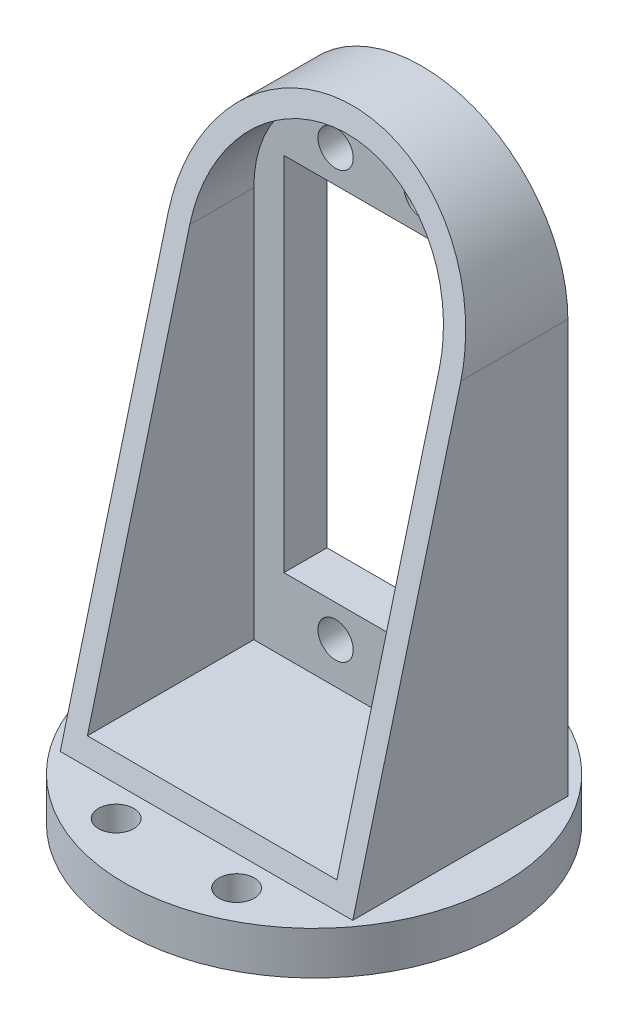
ISO-10303-21;
HEADER;
FILE_DESCRIPTION(('STEP AP214'),'2;1');
FILE_NAME('part.step','',(''),(''),'','','');
FILE_SCHEMA(('AUTOMOTIVE_DESIGN { 1 0 10303 214 1 1 1 1 }'));
ENDSEC;
DATA;
#1=APPLICATION_CONTEXT('core data for automotive mechanical design processes');
#2=APPLICATION_PROTOCOL_DEFINITION('international standard','automotive_design',2000,#1);
#3=PRODUCT_CONTEXT('',#1,'mechanical');
#4=PRODUCT('Part','Part','',(#3));
#5=PRODUCT_RELATED_PRODUCT_CATEGORY('part','',(#4));
#6=PRODUCT_DEFINITION_FORMATION('','',#4);
#7=PRODUCT_DEFINITION_CONTEXT('part definition',#1,'design');
#8=PRODUCT_DEFINITION('design','',#6,#7);
#9=PRODUCT_DEFINITION_SHAPE('','',#8);
#10=(LENGTH_UNIT() NAMED_UNIT(*) SI_UNIT(.MILLI.,.METRE.));
#11=(NAMED_UNIT(*) PLANE_ANGLE_UNIT() SI_UNIT($,.RADIAN.));
#12=(NAMED_UNIT(*) SI_UNIT($,.STERADIAN.) SOLID_ANGLE_UNIT());
#13=UNCERTAINTY_MEASURE_WITH_UNIT(LENGTH_MEASURE(1.E-05),#10,'distance_accuracy_value','');
#14=(GEOMETRIC_REPRESENTATION_CONTEXT(3) GLOBAL_UNCERTAINTY_ASSIGNED_CONTEXT((#13)) GLOBAL_UNIT_ASSIGNED_CONTEXT((#10,
#11,#12)) REPRESENTATION_CONTEXT('',''));
#15=CARTESIAN_POINT('',(0.,0.,0.));
#16=DIRECTION('',(0.,0.,1.));
#17=DIRECTION('',(1.,0.,0.));
#18=AXIS2_PLACEMENT_3D('',#15,#16,#17);
#19=CARTESIAN_POINT('',(17.,0.,5.));
#20=DIRECTION('',(1.,0.,0.));
#21=DIRECTION('',(0.,1.,0.));
#22=AXIS2_PLACEMENT_3D('',#19,#20,#21);
#23=PLANE('',#22);
#24=DIRECTION('',(0.,0.967459022681129,-0.253027744393526));
#25=VECTOR('',#24,1.);
#26=CARTESIAN_POINT('',(17.,-32.,25.));
#27=LINE('',#26,#25);
#28=CARTESIAN_POINT('',(17.,-32.,25.));
#29=VERTEX_POINT('',#28);
#30=CARTESIAN_POINT('',(17.,16.,12.4461538461538));
#31=VERTEX_POINT('',#30);
#32=EDGE_CURVE('E482',#29,#31,#27,.T.);
#33=ORIENTED_EDGE('',*,*,#32,.F.);
#34=DIRECTION('',(0.,0.,-1.));
#35=VECTOR('',#34,1.);
#36=CARTESIAN_POINT('',(17.,-32.,5.));
#37=LINE('',#36,#35);
#38=CARTESIAN_POINT('',(17.,-32.,0.));
#39=VERTEX_POINT('',#38);
#40=EDGE_CURVE('E174',#29,#39,#37,.T.);
#41=ORIENTED_EDGE('',*,*,#40,.T.);
#42=DIRECTION('',(0.,-1.,0.));
#43=VECTOR('',#42,1.);
#44=CARTESIAN_POINT('',(17.,0.,0.));
#45=LINE('',#44,#43);
#46=CARTESIAN_POINT('',(17.,16.,0.));
#47=VERTEX_POINT('',#46);
#48=EDGE_CURVE('E154',#47,#39,#45,.T.);
#49=ORIENTED_EDGE('',*,*,#48,.F.);
#50=DIRECTION('',(0.,0.,-1.));
#51=VECTOR('',#50,1.);
#52=CARTESIAN_POINT('',(17.,16.,5.));
#53=LINE('',#52,#51);
#54=EDGE_CURVE('E65',#31,#47,#53,.T.);
#55=ORIENTED_EDGE('',*,*,#54,.F.);
#56=EDGE_LOOP('',(#33,#41,#49,#55));
#57=FACE_BOUND('',#56,.T.);
#58=ADVANCED_FACE('F58',(#57),#23,.T.);
#59=CARTESIAN_POINT('',(0.,16.,5.));
#60=DIRECTION('',(0.,0.,-1.));
#61=DIRECTION('',(-1.,0.,0.));
#62=AXIS2_PLACEMENT_3D('',#59,#60,#61);
#63=CYLINDRICAL_SURFACE('',#62,17.);
#64=CARTESIAN_POINT('',(0.,16.,12.4461538461538));
#65=DIRECTION('',(0.,-0.253027744393526,-0.967459022681128));
#66=DIRECTION('',(0.,0.967459022681129,-0.253027744393526));
#67=AXIS2_PLACEMENT_3D('',#64,#65,#66);
#68=ELLIPSE('',#67,17.5718036644981,17.);
#69=CARTESIAN_POINT('',(-17.,16.,12.4461538461538));
#70=VERTEX_POINT('',#69);
#71=EDGE_CURVE('E183',#70,#31,#68,.T.);
#72=ORIENTED_EDGE('',*,*,#71,.T.);
#73=ORIENTED_EDGE('',*,*,#54,.T.);
#74=CARTESIAN_POINT('',(0.,16.,0.));
#75=DIRECTION('',(0.,0.,1.));
#76=DIRECTION('',(1.,0.,0.));
#77=AXIS2_PLACEMENT_3D('',#74,#75,#76);
#78=CIRCLE('',#77,17.);
#79=CARTESIAN_POINT('',(-17.,16.,0.));
#80=VERTEX_POINT('',#79);
#81=EDGE_CURVE('E169',#47,#80,#78,.T.);
#82=ORIENTED_EDGE('',*,*,#81,.T.);
#83=DIRECTION('',(0.,0.,-1.));
#84=VECTOR('',#83,1.);
#85=CARTESIAN_POINT('',(-17.,16.,5.));
#86=LINE('',#85,#84);
#87=EDGE_CURVE('E167',#70,#80,#86,.T.);
#88=ORIENTED_EDGE('',*,*,#87,.F.);
#89=EDGE_LOOP('',(#72,#73,#82,#88));
#90=FACE_BOUND('',#89,.T.);
#91=ADVANCED_FACE('F182',(#90),#63,.T.);
#92=CARTESIAN_POINT('',(-17.,0.,5.));
#93=DIRECTION('',(1.,0.,0.));
#94=DIRECTION('',(0.,1.,0.));
#95=AXIS2_PLACEMENT_3D('',#92,#93,#94);
#96=PLANE('',#95);
#97=DIRECTION('',(0.,0.,-1.));
#98=VECTOR('',#97,1.);
#99=CARTESIAN_POINT('',(-17.,-32.,5.));
#100=LINE('',#99,#98);
#101=CARTESIAN_POINT('',(-17.,-32.,25.));
#102=VERTEX_POINT('',#101);
#103=CARTESIAN_POINT('',(-17.,-32.,0.));
#104=VERTEX_POINT('',#103);
#105=EDGE_CURVE('E164',#102,#104,#100,.T.);
#106=ORIENTED_EDGE('',*,*,#105,.F.);
#107=DIRECTION('',(0.,0.967459022681129,-0.253027744393526));
#108=VECTOR('',#107,1.);
#109=CARTESIAN_POINT('',(-17.,-32.,25.));
#110=LINE('',#109,#108);
#111=EDGE_CURVE('E485',#102,#70,#110,.T.);
#112=ORIENTED_EDGE('',*,*,#111,.T.);
#113=ORIENTED_EDGE('',*,*,#87,.T.);
#114=DIRECTION('',(0.,-1.,0.));
#115=VECTOR('',#114,1.);
#116=CARTESIAN_POINT('',(-17.,0.,0.));
#117=LINE('',#116,#115);
#118=EDGE_CURVE('E152',#80,#104,#117,.T.);
#119=ORIENTED_EDGE('',*,*,#118,.T.);
#120=EDGE_LOOP('',(#106,#112,#113,#119));
#121=FACE_BOUND('',#120,.T.);
#122=ADVANCED_FACE('F162',(#121),#96,.F.);
#123=CARTESIAN_POINT('',(5.00000000000051,-24.75,5.));
#124=DIRECTION('',(0.,0.,-1.));
#125=DIRECTION('',(-1.,0.,0.));
#126=AXIS2_PLACEMENT_3D('',#123,#124,#125);
#127=CYLINDRICAL_SURFACE('',#126,2.05);
#128=CARTESIAN_POINT('',(5.00000000000051,-24.75,5.));
#129=DIRECTION('',(0.,0.,1.));
#130=DIRECTION('',(1.,0.,0.));
#131=AXIS2_PLACEMENT_3D('',#128,#129,#130);
#132=CIRCLE('',#131,2.05);
#133=CARTESIAN_POINT('',(7.05000000000051,-24.75,5.));
#134=VERTEX_POINT('',#133);
#135=EDGE_CURVE('E213',#134,#134,#132,.T.);
#136=ORIENTED_EDGE('',*,*,#135,.T.);
#137=EDGE_LOOP('',(#136));
#138=FACE_BOUND('',#137,.T.);
#139=CARTESIAN_POINT('',(5.00000000000051,-24.75,0.));
#140=DIRECTION('',(0.,0.,1.));
#141=DIRECTION('',(1.,0.,0.));
#142=AXIS2_PLACEMENT_3D('',#139,#140,#141);
#143=CIRCLE('',#142,2.05);
#144=CARTESIAN_POINT('',(7.05000000000051,-24.75,0.));
#145=VERTEX_POINT('',#144);
#146=EDGE_CURVE('E200',#145,#145,#143,.T.);
#147=ORIENTED_EDGE('',*,*,#146,.F.);
#148=EDGE_LOOP('',(#147));
#149=FACE_BOUND('',#148,.T.);
#150=ADVANCED_FACE('F249',(#138,#149),#127,.F.);
#151=CARTESIAN_POINT('',(-5.00000000000026,24.75,5.));
#152=DIRECTION('',(0.,0.,-1.));
#153=DIRECTION('',(-1.,0.,0.));
#154=AXIS2_PLACEMENT_3D('',#151,#152,#153);
#155=CYLINDRICAL_SURFACE('',#154,2.05000000000024);
#156=CARTESIAN_POINT('',(-5.00000000000026,24.75,5.));
#157=DIRECTION('',(0.,0.,1.));
#158=DIRECTION('',(1.,0.,0.));
#159=AXIS2_PLACEMENT_3D('',#156,#157,#158);
#160=CIRCLE('',#159,2.05000000000024);
#161=CARTESIAN_POINT('',(-2.95000000000002,24.75,5.));
#162=VERTEX_POINT('',#161);
#163=EDGE_CURVE('E208',#162,#162,#160,.T.);
#164=ORIENTED_EDGE('',*,*,#163,.T.);
#165=EDGE_LOOP('',(#164));
#166=FACE_BOUND('',#165,.T.);
#167=CARTESIAN_POINT('',(-5.00000000000026,24.75,0.));
#168=DIRECTION('',(0.,0.,1.));
#169=DIRECTION('',(1.,0.,0.));
#170=AXIS2_PLACEMENT_3D('',#167,#168,#169);
#171=CIRCLE('',#170,2.05000000000024);
#172=CARTESIAN_POINT('',(-2.95000000000002,24.75,0.));
#173=VERTEX_POINT('',#172);
#174=EDGE_CURVE('E197',#173,#173,#171,.T.);
#175=ORIENTED_EDGE('',*,*,#174,.F.);
#176=EDGE_LOOP('',(#175));
#177=FACE_BOUND('',#176,.T.);
#178=ADVANCED_FACE('F254',(#166,#177),#155,.F.);
#179=CARTESIAN_POINT('',(4.99999999999974,24.75,5.));
#180=DIRECTION('',(0.,0.,-1.));
#181=DIRECTION('',(-1.,0.,0.));
#182=AXIS2_PLACEMENT_3D('',#179,#180,#181);
#183=CYLINDRICAL_SURFACE('',#182,2.05000000000024);
#184=CARTESIAN_POINT('',(4.99999999999974,24.75,5.));
#185=DIRECTION('',(0.,0.,1.));
#186=DIRECTION('',(1.,0.,0.));
#187=AXIS2_PLACEMENT_3D('',#184,#185,#186);
#188=CIRCLE('',#187,2.05000000000024);
#189=CARTESIAN_POINT('',(7.04999999999999,24.75,5.));
#190=VERTEX_POINT('',#189);
#191=EDGE_CURVE('E204',#190,#190,#188,.T.);
#192=ORIENTED_EDGE('',*,*,#191,.T.);
#193=EDGE_LOOP('',(#192));
#194=FACE_BOUND('',#193,.T.);
#195=CARTESIAN_POINT('',(4.99999999999974,24.75,0.));
#196=DIRECTION('',(0.,0.,1.));
#197=DIRECTION('',(1.,0.,0.));
#198=AXIS2_PLACEMENT_3D('',#195,#196,#197);
#199=CIRCLE('',#198,2.05000000000024);
#200=CARTESIAN_POINT('',(7.04999999999999,24.75,0.));
#201=VERTEX_POINT('',#200);
#202=EDGE_CURVE('E158',#201,#201,#199,.T.);
#203=ORIENTED_EDGE('',*,*,#202,.F.);
#204=EDGE_LOOP('',(#203));
#205=FACE_BOUND('',#204,.T.);
#206=ADVANCED_FACE('F238',(#194,#205),#183,.F.);
#207=CARTESIAN_POINT('',(-4.99999999999949,-24.75,5.));
#208=DIRECTION('',(0.,0.,-1.));
#209=DIRECTION('',(-1.,0.,0.));
#210=AXIS2_PLACEMENT_3D('',#207,#208,#209);
#211=CYLINDRICAL_SURFACE('',#210,2.05);
#212=CARTESIAN_POINT('',(-4.99999999999949,-24.75,5.));
#213=DIRECTION('',(0.,0.,1.));
#214=DIRECTION('',(1.,0.,0.));
#215=AXIS2_PLACEMENT_3D('',#212,#213,#214);
#216=CIRCLE('',#215,2.05);
#217=CARTESIAN_POINT('',(-2.94999999999949,-24.75,5.));
#218=VERTEX_POINT('',#217);
#219=EDGE_CURVE('E177',#218,#218,#216,.T.);
#220=ORIENTED_EDGE('',*,*,#219,.T.);
#221=EDGE_LOOP('',(#220));
#222=FACE_BOUND('',#221,.T.);
#223=CARTESIAN_POINT('',(-4.99999999999949,-24.75,0.));
#224=DIRECTION('',(0.,0.,1.));
#225=DIRECTION('',(1.,0.,0.));
#226=AXIS2_PLACEMENT_3D('',#223,#224,#225);
#227=CIRCLE('',#226,2.05);
#228=CARTESIAN_POINT('',(-2.94999999999949,-24.75,0.));
#229=VERTEX_POINT('',#228);
#230=EDGE_CURVE('E202',#229,#229,#227,.T.);
#231=ORIENTED_EDGE('',*,*,#230,.F.);
#232=EDGE_LOOP('',(#231));
#233=FACE_BOUND('',#232,.T.);
#234=ADVANCED_FACE('F224',(#222,#233),#211,.F.);
#235=CARTESIAN_POINT('',(0.,0.,5.));
#236=DIRECTION('',(0.,0.,1.));
#237=DIRECTION('',(1.,0.,0.));
#238=AXIS2_PLACEMENT_3D('',#235,#236,#237);
#239=PLANE('',#238);
#240=CARTESIAN_POINT('',(0.,16.,5.));
#241=DIRECTION('',(0.,0.,1.));
#242=DIRECTION('',(1.,0.,0.));
#243=AXIS2_PLACEMENT_3D('',#240,#241,#242);
#244=CIRCLE('',#243,14.5);
#245=CARTESIAN_POINT('',(14.5,16.,5.));
#246=VERTEX_POINT('',#245);
#247=CARTESIAN_POINT('',(-14.5,16.,5.));
#248=VERTEX_POINT('',#247);
#249=EDGE_CURVE('E494',#246,#248,#244,.T.);
#250=ORIENTED_EDGE('',*,*,#249,.T.);
#251=DIRECTION('',(0.,-1.,0.));
#252=VECTOR('',#251,1.);
#253=CARTESIAN_POINT('',(-14.5,16.,5.));
#254=LINE('',#253,#252);
#255=CARTESIAN_POINT('',(-14.5,-29.5,5.));
#256=VERTEX_POINT('',#255);
#257=EDGE_CURVE('E496',#248,#256,#254,.T.);
#258=ORIENTED_EDGE('',*,*,#257,.T.);
#259=DIRECTION('',(1.,0.,0.));
#260=VECTOR('',#259,1.);
#261=CARTESIAN_POINT('',(-14.5,-29.5,5.));
#262=LINE('',#261,#260);
#263=CARTESIAN_POINT('',(14.5,-29.5,5.));
#264=VERTEX_POINT('',#263);
#265=EDGE_CURVE('E499',#256,#264,#262,.T.);
#266=ORIENTED_EDGE('',*,*,#265,.T.);
#267=DIRECTION('',(0.,1.,0.));
#268=VECTOR('',#267,1.);
#269=CARTESIAN_POINT('',(14.5,-29.5,5.));
#270=LINE('',#269,#268);
#271=EDGE_CURVE('E502',#264,#246,#270,.T.);
#272=ORIENTED_EDGE('',*,*,#271,.T.);
#273=EDGE_LOOP('',(#250,#258,#266,#272));
#274=FACE_BOUND('',#273,.T.);
#275=DIRECTION('',(1.,0.,0.));
#276=VECTOR('',#275,1.);
#277=CARTESIAN_POINT('',(-11.,21.,5.));
#278=LINE('',#277,#276);
#279=CARTESIAN_POINT('',(-11.,21.,5.));
#280=VERTEX_POINT('',#279);
#281=CARTESIAN_POINT('',(11.,21.,5.));
#282=VERTEX_POINT('',#281);
#283=EDGE_CURVE('E514',#280,#282,#278,.T.);
#284=ORIENTED_EDGE('',*,*,#283,.T.);
#285=DIRECTION('',(0.,1.,0.));
#286=VECTOR('',#285,1.);
#287=CARTESIAN_POINT('',(11.,-21.,5.));
#288=LINE('',#287,#286);
#289=CARTESIAN_POINT('',(11.,-21.,5.));
#290=VERTEX_POINT('',#289);
#291=EDGE_CURVE('E517',#290,#282,#288,.T.);
#292=ORIENTED_EDGE('',*,*,#291,.F.);
#293=DIRECTION('',(1.,0.,0.));
#294=VECTOR('',#293,1.);
#295=CARTESIAN_POINT('',(-11.,-21.,5.));
#296=LINE('',#295,#294);
#297=CARTESIAN_POINT('',(-11.,-21.,5.));
#298=VERTEX_POINT('',#297);
#299=EDGE_CURVE('E520',#298,#290,#296,.T.);
#300=ORIENTED_EDGE('',*,*,#299,.F.);
#301=DIRECTION('',(0.,1.,0.));
#302=VECTOR('',#301,1.);
#303=CARTESIAN_POINT('',(-11.,-21.,5.));
#304=LINE('',#303,#302);
#305=EDGE_CURVE('E523',#298,#280,#304,.T.);
#306=ORIENTED_EDGE('',*,*,#305,.T.);
#307=EDGE_LOOP('',(#284,#292,#300,#306));
#308=FACE_BOUND('',#307,.T.);
#309=ORIENTED_EDGE('',*,*,#191,.F.);
#310=EDGE_LOOP('',(#309));
#311=FACE_BOUND('',#310,.T.);
#312=ORIENTED_EDGE('',*,*,#163,.F.);
#313=EDGE_LOOP('',(#312));
#314=FACE_BOUND('',#313,.T.);
#315=ORIENTED_EDGE('',*,*,#135,.F.);
#316=EDGE_LOOP('',(#315));
#317=FACE_BOUND('',#316,.T.);
#318=ORIENTED_EDGE('',*,*,#219,.F.);
#319=EDGE_LOOP('',(#318));
#320=FACE_BOUND('',#319,.T.);
#321=ADVANCED_FACE('F227',(#274,#308,#311,#314,#317,#320),#239,.T.);
#322=CARTESIAN_POINT('',(0.,0.,0.));
#323=DIRECTION('',(0.,0.,1.));
#324=DIRECTION('',(1.,0.,0.));
#325=AXIS2_PLACEMENT_3D('',#322,#323,#324);
#326=PLANE('',#325);
#327=DIRECTION('',(0.,1.,0.));
#328=VECTOR('',#327,1.);
#329=CARTESIAN_POINT('',(11.,-21.,0.));
#330=LINE('',#329,#328);
#331=CARTESIAN_POINT('',(11.,-21.,0.));
#332=VERTEX_POINT('',#331);
#333=CARTESIAN_POINT('',(11.,21.,0.));
#334=VERTEX_POINT('',#333);
#335=EDGE_CURVE('E527',#332,#334,#330,.T.);
#336=ORIENTED_EDGE('',*,*,#335,.T.);
#337=DIRECTION('',(1.,0.,0.));
#338=VECTOR('',#337,1.);
#339=CARTESIAN_POINT('',(-11.,21.,0.));
#340=LINE('',#339,#338);
#341=CARTESIAN_POINT('',(-11.,21.,0.));
#342=VERTEX_POINT('',#341);
#343=EDGE_CURVE('E513',#342,#334,#340,.T.);
#344=ORIENTED_EDGE('',*,*,#343,.F.);
#345=DIRECTION('',(0.,1.,0.));
#346=VECTOR('',#345,1.);
#347=CARTESIAN_POINT('',(-11.,-21.,0.));
#348=LINE('',#347,#346);
#349=CARTESIAN_POINT('',(-11.,-21.,0.));
#350=VERTEX_POINT('',#349);
#351=EDGE_CURVE('E518',#350,#342,#348,.T.);
#352=ORIENTED_EDGE('',*,*,#351,.F.);
#353=DIRECTION('',(1.,0.,0.));
#354=VECTOR('',#353,1.);
#355=CARTESIAN_POINT('',(-11.,-21.,0.));
#356=LINE('',#355,#354);
#357=EDGE_CURVE('E530',#350,#332,#356,.T.);
#358=ORIENTED_EDGE('',*,*,#357,.T.);
#359=EDGE_LOOP('',(#336,#344,#352,#358));
#360=FACE_BOUND('',#359,.T.);
#361=ORIENTED_EDGE('',*,*,#48,.T.);
#362=DIRECTION('',(-1.,0.,0.));
#363=VECTOR('',#362,1.);
#364=CARTESIAN_POINT('',(0.,-32.,0.));
#365=LINE('',#364,#363);
#366=EDGE_CURVE('E147',#39,#104,#365,.T.);
#367=ORIENTED_EDGE('',*,*,#366,.T.);
#368=ORIENTED_EDGE('',*,*,#118,.F.);
#369=ORIENTED_EDGE('',*,*,#81,.F.);
#370=EDGE_LOOP('',(#361,#367,#368,#369));
#371=FACE_BOUND('',#370,.T.);
#372=ORIENTED_EDGE('',*,*,#202,.T.);
#373=EDGE_LOOP('',(#372));
#374=FACE_BOUND('',#373,.T.);
#375=ORIENTED_EDGE('',*,*,#174,.T.);
#376=EDGE_LOOP('',(#375));
#377=FACE_BOUND('',#376,.T.);
#378=ORIENTED_EDGE('',*,*,#146,.T.);
#379=EDGE_LOOP('',(#378));
#380=FACE_BOUND('',#379,.T.);
#381=ORIENTED_EDGE('',*,*,#230,.T.);
#382=EDGE_LOOP('',(#381));
#383=FACE_BOUND('',#382,.T.);
#384=ADVANCED_FACE('F149',(#360,#371,#374,#377,#380,#383),#326,.F.);
#385=CARTESIAN_POINT('',(-11.,21.,5.));
#386=DIRECTION('',(0.,1.,0.));
#387=DIRECTION('',(0.,0.,1.));
#388=AXIS2_PLACEMENT_3D('',#385,#386,#387);
#389=PLANE('',#388);
#390=ORIENTED_EDGE('',*,*,#343,.T.);
#391=DIRECTION('',(0.,0.,-1.));
#392=VECTOR('',#391,1.);
#393=CARTESIAN_POINT('',(11.,21.,5.));
#394=LINE('',#393,#392);
#395=EDGE_CURVE('E216',#282,#334,#394,.T.);
#396=ORIENTED_EDGE('',*,*,#395,.F.);
#397=ORIENTED_EDGE('',*,*,#283,.F.);
#398=DIRECTION('',(0.,0.,-1.));
#399=VECTOR('',#398,1.);
#400=CARTESIAN_POINT('',(-11.,21.,5.));
#401=LINE('',#400,#399);
#402=EDGE_CURVE('E188',#280,#342,#401,.T.);
#403=ORIENTED_EDGE('',*,*,#402,.T.);
#404=EDGE_LOOP('',(#390,#396,#397,#403));
#405=FACE_BOUND('',#404,.T.);
#406=ADVANCED_FACE('F235',(#405),#389,.F.);
#407=CARTESIAN_POINT('',(-11.,-21.,5.));
#408=DIRECTION('',(-1.,0.,0.));
#409=DIRECTION('',(0.,-1.,0.));
#410=AXIS2_PLACEMENT_3D('',#407,#408,#409);
#411=PLANE('',#410);
#412=ORIENTED_EDGE('',*,*,#351,.T.);
#413=ORIENTED_EDGE('',*,*,#402,.F.);
#414=ORIENTED_EDGE('',*,*,#305,.F.);
#415=DIRECTION('',(0.,0.,-1.));
#416=VECTOR('',#415,1.);
#417=CARTESIAN_POINT('',(-11.,-21.,5.));
#418=LINE('',#417,#416);
#419=EDGE_CURVE('E190',#298,#350,#418,.T.);
#420=ORIENTED_EDGE('',*,*,#419,.T.);
#421=EDGE_LOOP('',(#412,#413,#414,#420));
#422=FACE_BOUND('',#421,.T.);
#423=ADVANCED_FACE('F288',(#422),#411,.F.);
#424=CARTESIAN_POINT('',(-11.,-21.,5.));
#425=DIRECTION('',(0.,1.,0.));
#426=DIRECTION('',(0.,0.,1.));
#427=AXIS2_PLACEMENT_3D('',#424,#425,#426);
#428=PLANE('',#427);
#429=ORIENTED_EDGE('',*,*,#357,.F.);
#430=ORIENTED_EDGE('',*,*,#419,.F.);
#431=ORIENTED_EDGE('',*,*,#299,.T.);
#432=DIRECTION('',(0.,0.,-1.));
#433=VECTOR('',#432,1.);
#434=CARTESIAN_POINT('',(11.,-21.,5.));
#435=LINE('',#434,#433);
#436=EDGE_CURVE('E535',#290,#332,#435,.T.);
#437=ORIENTED_EDGE('',*,*,#436,.T.);
#438=EDGE_LOOP('',(#429,#430,#431,#437));
#439=FACE_BOUND('',#438,.T.);
#440=ADVANCED_FACE('F298',(#439),#428,.T.);
#441=CARTESIAN_POINT('',(11.,-21.,5.));
#442=DIRECTION('',(-1.,0.,0.));
#443=DIRECTION('',(0.,-1.,0.));
#444=AXIS2_PLACEMENT_3D('',#441,#442,#443);
#445=PLANE('',#444);
#446=ORIENTED_EDGE('',*,*,#335,.F.);
#447=ORIENTED_EDGE('',*,*,#436,.F.);
#448=ORIENTED_EDGE('',*,*,#291,.T.);
#449=ORIENTED_EDGE('',*,*,#395,.T.);
#450=EDGE_LOOP('',(#446,#447,#448,#449));
#451=FACE_BOUND('',#450,.T.);
#452=ADVANCED_FACE('F308',(#451),#445,.T.);
#453=CARTESIAN_POINT('',(0.,16.,25.));
#454=DIRECTION('',(0.,0.,-1.));
#455=DIRECTION('',(-1.,0.,0.));
#456=AXIS2_PLACEMENT_3D('',#453,#454,#455);
#457=CYLINDRICAL_SURFACE('',#456,14.5);
#458=CARTESIAN_POINT('',(0.,16.,12.4461538461538));
#459=DIRECTION('',(0.,-0.253027744393526,-0.967459022681128));
#460=DIRECTION('',(0.,0.967459022681129,-0.253027744393526));
#461=AXIS2_PLACEMENT_3D('',#458,#459,#460);
#462=ELLIPSE('',#461,14.9877148903072,14.5);
#463=CARTESIAN_POINT('',(-14.5,16.,12.4461538461538));
#464=VERTEX_POINT('',#463);
#465=CARTESIAN_POINT('',(14.5,16.,12.4461538461538));
#466=VERTEX_POINT('',#465);
#467=EDGE_CURVE('E71',#464,#466,#462,.T.);
#468=ORIENTED_EDGE('',*,*,#467,.F.);
#469=DIRECTION('',(0.,0.,-1.));
#470=VECTOR('',#469,1.);
#471=CARTESIAN_POINT('',(-14.5,16.,25.));
#472=LINE('',#471,#470);
#473=EDGE_CURVE('E78',#464,#248,#472,.T.);
#474=ORIENTED_EDGE('',*,*,#473,.T.);
#475=ORIENTED_EDGE('',*,*,#249,.F.);
#476=DIRECTION('',(0.,0.,-1.));
#477=VECTOR('',#476,1.);
#478=CARTESIAN_POINT('',(14.5,16.,25.));
#479=LINE('',#478,#477);
#480=EDGE_CURVE('E505',#466,#246,#479,.T.);
#481=ORIENTED_EDGE('',*,*,#480,.F.);
#482=EDGE_LOOP('',(#468,#474,#475,#481));
#483=FACE_BOUND('',#482,.T.);
#484=ADVANCED_FACE('F317',(#483),#457,.F.);
#485=CARTESIAN_POINT('',(-14.5,16.,25.));
#486=DIRECTION('',(1.,0.,0.));
#487=DIRECTION('',(0.,0.,-1.));
#488=AXIS2_PLACEMENT_3D('',#485,#486,#487);
#489=PLANE('',#488);
#490=DIRECTION('',(0.,0.967459022681129,-0.253027744393526));
#491=VECTOR('',#490,1.);
#492=CARTESIAN_POINT('',(-14.5,12.926894107222,13.2498892334958));
#493=LINE('',#492,#491);
#494=CARTESIAN_POINT('',(-14.5,-29.5,24.3461538461538));
#495=VERTEX_POINT('',#494);
#496=EDGE_CURVE('E490',#495,#464,#493,.T.);
#497=ORIENTED_EDGE('',*,*,#496,.F.);
#498=DIRECTION('',(0.,0.,-1.));
#499=VECTOR('',#498,1.);
#500=CARTESIAN_POINT('',(-14.5,-29.5,25.));
#501=LINE('',#500,#499);
#502=EDGE_CURVE('E509',#495,#256,#501,.T.);
#503=ORIENTED_EDGE('',*,*,#502,.T.);
#504=ORIENTED_EDGE('',*,*,#257,.F.);
#505=ORIENTED_EDGE('',*,*,#473,.F.);
#506=EDGE_LOOP('',(#497,#503,#504,#505));
#507=FACE_BOUND('',#506,.T.);
#508=ADVANCED_FACE('F341',(#507),#489,.T.);
#509=CARTESIAN_POINT('',(-14.5,-29.5,25.));
#510=DIRECTION('',(0.,1.,0.));
#511=DIRECTION('',(0.,0.,1.));
#512=AXIS2_PLACEMENT_3D('',#509,#510,#511);
#513=PLANE('',#512);
#514=DIRECTION('',(-1.,0.,0.));
#515=VECTOR('',#514,1.);
#516=CARTESIAN_POINT('',(-14.5,-29.5,24.3461538461538));
#517=LINE('',#516,#515);
#518=CARTESIAN_POINT('',(14.5,-29.5,24.3461538461538));
#519=VERTEX_POINT('',#518);
#520=EDGE_CURVE('E487',#519,#495,#517,.T.);
#521=ORIENTED_EDGE('',*,*,#520,.F.);
#522=DIRECTION('',(0.,0.,-1.));
#523=VECTOR('',#522,1.);
#524=CARTESIAN_POINT('',(14.5,-29.5,25.));
#525=LINE('',#524,#523);
#526=EDGE_CURVE('E507',#519,#264,#525,.T.);
#527=ORIENTED_EDGE('',*,*,#526,.T.);
#528=ORIENTED_EDGE('',*,*,#265,.F.);
#529=ORIENTED_EDGE('',*,*,#502,.F.);
#530=EDGE_LOOP('',(#521,#527,#528,#529));
#531=FACE_BOUND('',#530,.T.);
#532=ADVANCED_FACE('F350',(#531),#513,.T.);
#533=CARTESIAN_POINT('',(14.5,-29.5,25.));
#534=DIRECTION('',(-1.,0.,0.));
#535=DIRECTION('',(0.,-1.,0.));
#536=AXIS2_PLACEMENT_3D('',#533,#534,#535);
#537=PLANE('',#536);
#538=DIRECTION('',(0.,-0.967459022681129,0.253027744393526));
#539=VECTOR('',#538,1.);
#540=CARTESIAN_POINT('',(14.5,-29.6600575985822,24.3880150642446));
#541=LINE('',#540,#539);
#542=EDGE_CURVE('E12',#466,#519,#541,.T.);
#543=ORIENTED_EDGE('',*,*,#542,.F.);
#544=ORIENTED_EDGE('',*,*,#480,.T.);
#545=ORIENTED_EDGE('',*,*,#271,.F.);
#546=ORIENTED_EDGE('',*,*,#526,.F.);
#547=EDGE_LOOP('',(#543,#544,#545,#546));
#548=FACE_BOUND('',#547,.T.);
#549=ADVANCED_FACE('F360',(#548),#537,.T.);
#550=CARTESIAN_POINT('',(-17.,-32.,25.));
#551=DIRECTION('',(0.,-0.253027744393526,-0.967459022681128));
#552=DIRECTION('',(0.,0.967459022681129,-0.253027744393526));
#553=AXIS2_PLACEMENT_3D('',#550,#551,#552);
#554=PLANE('',#553);
#555=ORIENTED_EDGE('',*,*,#467,.T.);
#556=ORIENTED_EDGE('',*,*,#542,.T.);
#557=ORIENTED_EDGE('',*,*,#520,.T.);
#558=ORIENTED_EDGE('',*,*,#496,.T.);
#559=EDGE_LOOP('',(#555,#556,#557,#558));
#560=FACE_BOUND('',#559,.T.);
#561=ORIENTED_EDGE('',*,*,#71,.F.);
#562=ORIENTED_EDGE('',*,*,#111,.F.);
#563=DIRECTION('',(1.,0.,0.));
#564=VECTOR('',#563,1.);
#565=CARTESIAN_POINT('',(-17.,-32.,25.));
#566=LINE('',#565,#564);
#567=EDGE_CURVE('E173',#102,#29,#566,.T.);
#568=ORIENTED_EDGE('',*,*,#567,.T.);
#569=ORIENTED_EDGE('',*,*,#32,.T.);
#570=EDGE_LOOP('',(#561,#562,#568,#569));
#571=FACE_BOUND('',#570,.T.);
#572=ADVANCED_FACE('F369',(#560,#571),#554,.F.);
#573=CARTESIAN_POINT('',(0.,-37.,12.5));
#574=DIRECTION('',(0.,1.,0.));
#575=DIRECTION('',(-1.,0.,0.));
#576=AXIS2_PLACEMENT_3D('',#573,#574,#575);
#577=CYLINDRICAL_SURFACE('',#576,22.);
#578=CARTESIAN_POINT('',(0.,-37.,12.5));
#579=DIRECTION('',(0.,-1.,0.));
#580=DIRECTION('',(1.,0.,0.));
#581=AXIS2_PLACEMENT_3D('',#578,#579,#580);
#582=CIRCLE('',#581,22.);
#583=CARTESIAN_POINT('',(22.,-37.,12.5));
#584=VERTEX_POINT('',#583);
#585=EDGE_CURVE('E479',#584,#584,#582,.T.);
#586=ORIENTED_EDGE('',*,*,#585,.F.);
#587=EDGE_LOOP('',(#586));
#588=FACE_BOUND('',#587,.T.);
#589=CARTESIAN_POINT('',(0.,-32.,12.5));
#590=DIRECTION('',(0.,-1.,0.));
#591=DIRECTION('',(1.,0.,0.));
#592=AXIS2_PLACEMENT_3D('',#589,#590,#591);
#593=CIRCLE('',#592,22.);
#594=CARTESIAN_POINT('',(22.,-32.,12.5));
#595=VERTEX_POINT('',#594);
#596=EDGE_CURVE('E465',#595,#595,#593,.T.);
#597=ORIENTED_EDGE('',*,*,#596,.T.);
#598=EDGE_LOOP('',(#597));
#599=FACE_BOUND('',#598,.T.);
#600=ADVANCED_FACE('F394',(#588,#599),#577,.T.);
#601=CARTESIAN_POINT('',(0.,-37.,12.5));
#602=DIRECTION('',(0.,-1.,0.));
#603=DIRECTION('',(1.,0.,0.));
#604=AXIS2_PLACEMENT_3D('',#601,#602,#603);
#605=PLANE('',#604);
#606=CARTESIAN_POINT('',(0.,-37.,-5.));
#607=DIRECTION('',(0.,1.,0.));
#608=DIRECTION('',(-1.,0.,0.));
#609=AXIS2_PLACEMENT_3D('',#606,#607,#608);
#610=CIRCLE('',#609,2.05);
#611=CARTESIAN_POINT('',(-2.04999999999999,-37.,-5.));
#612=VERTEX_POINT('',#611);
#613=EDGE_CURVE('E459',#612,#612,#610,.T.);
#614=ORIENTED_EDGE('',*,*,#613,.T.);
#615=EDGE_LOOP('',(#614));
#616=FACE_BOUND('',#615,.T.);
#617=CARTESIAN_POINT('',(-6.99999999999999,-37.,28.5));
#618=DIRECTION('',(0.,1.,0.));
#619=DIRECTION('',(-1.,0.,0.));
#620=AXIS2_PLACEMENT_3D('',#617,#618,#619);
#621=CIRCLE('',#620,2.05);
#622=CARTESIAN_POINT('',(-9.04999999999999,-37.,28.5));
#623=VERTEX_POINT('',#622);
#624=EDGE_CURVE('E463',#623,#623,#621,.T.);
#625=ORIENTED_EDGE('',*,*,#624,.T.);
#626=EDGE_LOOP('',(#625));
#627=FACE_BOUND('',#626,.T.);
#628=CARTESIAN_POINT('',(7.00000000000001,-37.,28.5));
#629=DIRECTION('',(0.,1.,0.));
#630=DIRECTION('',(-1.,0.,0.));
#631=AXIS2_PLACEMENT_3D('',#628,#629,#630);
#632=CIRCLE('',#631,2.05);
#633=CARTESIAN_POINT('',(4.95000000000001,-37.,28.5));
#634=VERTEX_POINT('',#633);
#635=EDGE_CURVE('E473',#634,#634,#632,.T.);
#636=ORIENTED_EDGE('',*,*,#635,.T.);
#637=EDGE_LOOP('',(#636));
#638=FACE_BOUND('',#637,.T.);
#639=ORIENTED_EDGE('',*,*,#585,.T.);
#640=EDGE_LOOP('',(#639));
#641=FACE_BOUND('',#640,.T.);
#642=ADVANCED_FACE('F403',(#616,#627,#638,#641),#605,.T.);
#643=CARTESIAN_POINT('',(0.,-32.,12.5));
#644=DIRECTION('',(0.,-1.,0.));
#645=DIRECTION('',(1.,0.,0.));
#646=AXIS2_PLACEMENT_3D('',#643,#644,#645);
#647=PLANE('',#646);
#648=CARTESIAN_POINT('',(0.,-32.,-5.));
#649=DIRECTION('',(0.,1.,0.));
#650=DIRECTION('',(-1.,0.,0.));
#651=AXIS2_PLACEMENT_3D('',#648,#649,#650);
#652=CIRCLE('',#651,2.05);
#653=CARTESIAN_POINT('',(-2.04999999999999,-32.,-5.));
#654=VERTEX_POINT('',#653);
#655=EDGE_CURVE('E462',#654,#654,#652,.T.);
#656=ORIENTED_EDGE('',*,*,#655,.F.);
#657=EDGE_LOOP('',(#656));
#658=FACE_BOUND('',#657,.T.);
#659=CARTESIAN_POINT('',(-6.99999999999999,-32.,28.5));
#660=DIRECTION('',(0.,1.,0.));
#661=DIRECTION('',(-1.,0.,0.));
#662=AXIS2_PLACEMENT_3D('',#659,#660,#661);
#663=CIRCLE('',#662,2.05);
#664=CARTESIAN_POINT('',(-9.04999999999999,-32.,28.5));
#665=VERTEX_POINT('',#664);
#666=EDGE_CURVE('E468',#665,#665,#663,.T.);
#667=ORIENTED_EDGE('',*,*,#666,.F.);
#668=EDGE_LOOP('',(#667));
#669=FACE_BOUND('',#668,.T.);
#670=CARTESIAN_POINT('',(7.00000000000001,-32.,28.5));
#671=DIRECTION('',(0.,1.,0.));
#672=DIRECTION('',(-1.,0.,0.));
#673=AXIS2_PLACEMENT_3D('',#670,#671,#672);
#674=CIRCLE('',#673,2.05);
#675=CARTESIAN_POINT('',(4.95000000000001,-32.,28.5));
#676=VERTEX_POINT('',#675);
#677=EDGE_CURVE('E476',#676,#676,#674,.T.);
#678=ORIENTED_EDGE('',*,*,#677,.F.);
#679=EDGE_LOOP('',(#678));
#680=FACE_BOUND('',#679,.T.);
#681=ORIENTED_EDGE('',*,*,#366,.F.);
#682=ORIENTED_EDGE('',*,*,#40,.F.);
#683=ORIENTED_EDGE('',*,*,#567,.F.);
#684=ORIENTED_EDGE('',*,*,#105,.T.);
#685=EDGE_LOOP('',(#681,#682,#683,#684));
#686=FACE_BOUND('',#685,.T.);
#687=ORIENTED_EDGE('',*,*,#596,.F.);
#688=EDGE_LOOP('',(#687));
#689=FACE_BOUND('',#688,.T.);
#690=ADVANCED_FACE('F171',(#658,#669,#680,#686,#689),#647,.F.);
#691=CARTESIAN_POINT('',(7.00000000000001,-37.,28.5));
#692=DIRECTION('',(0.,1.,0.));
#693=DIRECTION('',(-1.,0.,0.));
#694=AXIS2_PLACEMENT_3D('',#691,#692,#693);
#695=CYLINDRICAL_SURFACE('',#694,2.05);
#696=ORIENTED_EDGE('',*,*,#635,.F.);
#697=EDGE_LOOP('',(#696));
#698=FACE_BOUND('',#697,.T.);
#699=ORIENTED_EDGE('',*,*,#677,.T.);
#700=EDGE_LOOP('',(#699));
#701=FACE_BOUND('',#700,.T.);
#702=ADVANCED_FACE('F422',(#698,#701),#695,.F.);
#703=CARTESIAN_POINT('',(-6.99999999999999,-37.,28.5));
#704=DIRECTION('',(0.,1.,0.));
#705=DIRECTION('',(-1.,0.,0.));
#706=AXIS2_PLACEMENT_3D('',#703,#704,#705);
#707=CYLINDRICAL_SURFACE('',#706,2.05);
#708=ORIENTED_EDGE('',*,*,#624,.F.);
#709=EDGE_LOOP('',(#708));
#710=FACE_BOUND('',#709,.T.);
#711=ORIENTED_EDGE('',*,*,#666,.T.);
#712=EDGE_LOOP('',(#711));
#713=FACE_BOUND('',#712,.T.);
#714=ADVANCED_FACE('F432',(#710,#713),#707,.F.);
#715=CARTESIAN_POINT('',(0.,-37.,-5.));
#716=DIRECTION('',(0.,1.,0.));
#717=DIRECTION('',(-1.,0.,0.));
#718=AXIS2_PLACEMENT_3D('',#715,#716,#717);
#719=CYLINDRICAL_SURFACE('',#718,2.05);
#720=ORIENTED_EDGE('',*,*,#613,.F.);
#721=EDGE_LOOP('',(#720));
#722=FACE_BOUND('',#721,.T.);
#723=ORIENTED_EDGE('',*,*,#655,.T.);
#724=EDGE_LOOP('',(#723));
#725=FACE_BOUND('',#724,.T.);
#726=ADVANCED_FACE('F442',(#722,#725),#719,.F.);
#727=CLOSED_SHELL('',(#58,#91,#122,#150,#178,#206,#234,#321,#384,#406,#423,#440,#452,#484,#508,
#532,#549,#572,#600,#642,#690,#702,#714,#726));
#728=MANIFOLD_SOLID_BREP('B2',#727);
#729=ADVANCED_BREP_SHAPE_REPRESENTATION('',(#18,#728),#14);
#730=SHAPE_DEFINITION_REPRESENTATION(#9,#729);
ENDSEC;
END-ISO-10303-21;
